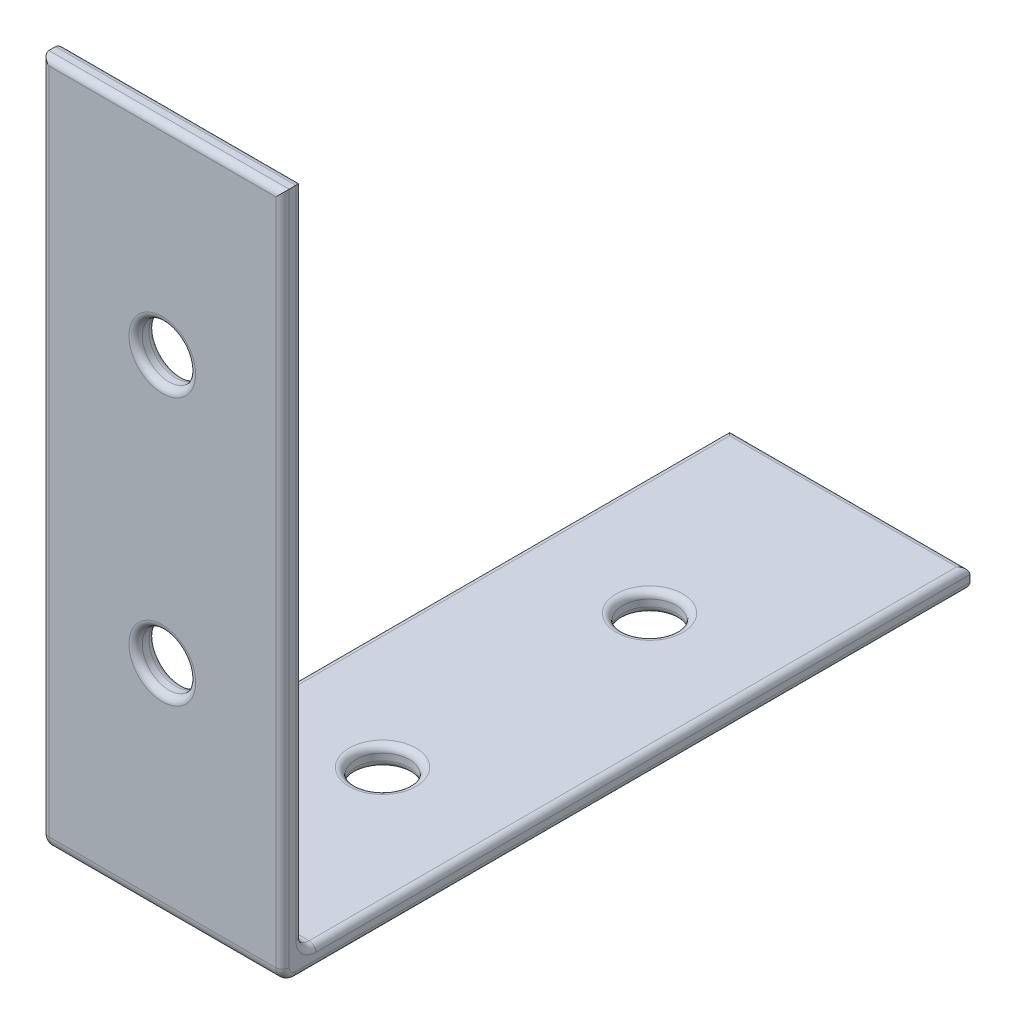
ISO-10303-21;
HEADER;
FILE_DESCRIPTION(('STEP AP214'),'2;1');
FILE_NAME('part.step','',(''),(''),'','','');
FILE_SCHEMA(('AUTOMOTIVE_DESIGN { 1 0 10303 214 1 1 1 1 }'));
ENDSEC;
DATA;
#1=APPLICATION_CONTEXT('core data for automotive mechanical design processes');
#2=APPLICATION_PROTOCOL_DEFINITION('international standard','automotive_design',2000,#1);
#3=PRODUCT_CONTEXT('',#1,'mechanical');
#4=PRODUCT('Part','Part','',(#3));
#5=PRODUCT_RELATED_PRODUCT_CATEGORY('part','',(#4));
#6=PRODUCT_DEFINITION_FORMATION('','',#4);
#7=PRODUCT_DEFINITION_CONTEXT('part definition',#1,'design');
#8=PRODUCT_DEFINITION('design','',#6,#7);
#9=PRODUCT_DEFINITION_SHAPE('','',#8);
#10=(LENGTH_UNIT() NAMED_UNIT(*) SI_UNIT(.MILLI.,.METRE.));
#11=(NAMED_UNIT(*) PLANE_ANGLE_UNIT() SI_UNIT($,.RADIAN.));
#12=(NAMED_UNIT(*) SI_UNIT($,.STERADIAN.) SOLID_ANGLE_UNIT());
#13=UNCERTAINTY_MEASURE_WITH_UNIT(LENGTH_MEASURE(1.E-05),#10,'distance_accuracy_value','');
#14=(GEOMETRIC_REPRESENTATION_CONTEXT(3) GLOBAL_UNCERTAINTY_ASSIGNED_CONTEXT((#13)) GLOBAL_UNIT_ASSIGNED_CONTEXT((#10,
#11,#12)) REPRESENTATION_CONTEXT('',''));
#15=CARTESIAN_POINT('',(0.,0.,0.));
#16=DIRECTION('',(0.,0.,1.));
#17=DIRECTION('',(1.,0.,0.));
#18=AXIS2_PLACEMENT_3D('',#15,#16,#17);
#19=CARTESIAN_POINT('',(18.,1.,-1.));
#20=DIRECTION('',(-1.,0.,0.));
#21=DIRECTION('',(0.,0.,1.));
#22=AXIS2_PLACEMENT_3D('',#19,#20,#21);
#23=CYLINDRICAL_SURFACE('',#22,1.);
#24=DIRECTION('',(-1.,0.,0.));
#25=VECTOR('',#24,1.);
#26=CARTESIAN_POINT('',(18.,1.00000000000001,0.));
#27=LINE('',#26,#25);
#28=CARTESIAN_POINT('',(17.5,1.00000000000001,0.));
#29=VERTEX_POINT('',#28);
#30=CARTESIAN_POINT('',(0.5,1.00000000000001,0.));
#31=VERTEX_POINT('',#30);
#32=EDGE_CURVE('E375',#29,#31,#27,.T.);
#33=ORIENTED_EDGE('',*,*,#32,.T.);
#34=CARTESIAN_POINT('',(0.5,1.,-1.));
#35=DIRECTION('',(1.,0.,0.));
#36=DIRECTION('',(0.,0.,-1.));
#37=AXIS2_PLACEMENT_3D('',#34,#35,#36);
#38=CIRCLE('',#37,1.);
#39=CARTESIAN_POINT('',(0.5,0.,-1.00000000000001));
#40=VERTEX_POINT('',#39);
#41=EDGE_CURVE('E168',#31,#40,#38,.T.);
#42=ORIENTED_EDGE('',*,*,#41,.T.);
#43=DIRECTION('',(-1.,0.,0.));
#44=VECTOR('',#43,1.);
#45=CARTESIAN_POINT('',(18.,0.,-1.00000000000001));
#46=LINE('',#45,#44);
#47=CARTESIAN_POINT('',(17.5,0.,-1.00000000000001));
#48=VERTEX_POINT('',#47);
#49=EDGE_CURVE('E154',#48,#40,#46,.T.);
#50=ORIENTED_EDGE('',*,*,#49,.F.);
#51=CARTESIAN_POINT('',(17.5,1.,-1.));
#52=DIRECTION('',(1.,0.,0.));
#53=DIRECTION('',(0.,0.,-1.));
#54=AXIS2_PLACEMENT_3D('',#51,#52,#53);
#55=CIRCLE('',#54,1.);
#56=EDGE_CURVE('E166',#48,#29,#55,.F.);
#57=ORIENTED_EDGE('',*,*,#56,.T.);
#58=EDGE_LOOP('',(#33,#42,#50,#57));
#59=FACE_BOUND('',#58,.T.);
#60=ADVANCED_FACE('F36',(#59),#23,.T.);
#61=CARTESIAN_POINT('',(18.,0.,0.));
#62=DIRECTION('',(0.,1.,0.));
#63=DIRECTION('',(0.,0.,1.));
#64=AXIS2_PLACEMENT_3D('',#61,#62,#63);
#65=PLANE('',#64);
#66=CARTESIAN_POINT('',(9.,0.,-36.5));
#67=DIRECTION('',(0.,1.,0.));
#68=DIRECTION('',(0.,0.,1.));
#69=AXIS2_PLACEMENT_3D('',#66,#67,#68);
#70=CIRCLE('',#69,2.5);
#71=CARTESIAN_POINT('',(9.,0.,-34.));
#72=VERTEX_POINT('',#71);
#73=EDGE_CURVE('E396',#72,#72,#70,.T.);
#74=ORIENTED_EDGE('',*,*,#73,.T.);
#75=EDGE_LOOP('',(#74));
#76=FACE_BOUND('',#75,.T.);
#77=CARTESIAN_POINT('',(9.,0.,-16.5));
#78=DIRECTION('',(0.,1.,0.));
#79=DIRECTION('',(0.,0.,1.));
#80=AXIS2_PLACEMENT_3D('',#77,#78,#79);
#81=CIRCLE('',#80,2.5);
#82=CARTESIAN_POINT('',(9.,0.,-14.));
#83=VERTEX_POINT('',#82);
#84=EDGE_CURVE('E393',#83,#83,#81,.T.);
#85=ORIENTED_EDGE('',*,*,#84,.T.);
#86=EDGE_LOOP('',(#85));
#87=FACE_BOUND('',#86,.T.);
#88=ORIENTED_EDGE('',*,*,#49,.T.);
#89=DIRECTION('',(0.,0.,-1.));
#90=VECTOR('',#89,1.);
#91=CARTESIAN_POINT('',(0.5,0.,0.));
#92=LINE('',#91,#90);
#93=CARTESIAN_POINT('',(0.5,0.,-51.));
#94=VERTEX_POINT('',#93);
#95=EDGE_CURVE('E391',#40,#94,#92,.T.);
#96=ORIENTED_EDGE('',*,*,#95,.T.);
#97=DIRECTION('',(-1.,0.,0.));
#98=VECTOR('',#97,1.);
#99=CARTESIAN_POINT('',(18.,0.,-51.));
#100=LINE('',#99,#98);
#101=CARTESIAN_POINT('',(17.5,0.,-51.));
#102=VERTEX_POINT('',#101);
#103=EDGE_CURVE('E157',#94,#102,#100,.F.);
#104=ORIENTED_EDGE('',*,*,#103,.T.);
#105=DIRECTION('',(0.,0.,-1.));
#106=VECTOR('',#105,1.);
#107=CARTESIAN_POINT('',(17.5,0.,-1.00000000000001));
#108=LINE('',#107,#106);
#109=EDGE_CURVE('E150',#102,#48,#108,.F.);
#110=ORIENTED_EDGE('',*,*,#109,.T.);
#111=EDGE_LOOP('',(#88,#96,#104,#110));
#112=FACE_BOUND('',#111,.T.);
#113=ADVANCED_FACE('F152',(#76,#87,#112),#65,.F.);
#114=CARTESIAN_POINT('',(18.,0.,-51.5));
#115=DIRECTION('',(0.,0.,1.));
#116=DIRECTION('',(1.,0.,0.));
#117=AXIS2_PLACEMENT_3D('',#114,#115,#116);
#118=PLANE('',#117);
#119=DIRECTION('',(0.,1.,0.));
#120=VECTOR('',#119,1.);
#121=CARTESIAN_POINT('',(18.,0.,-51.5));
#122=LINE('',#121,#120);
#123=CARTESIAN_POINT('',(18.,0.5,-51.5));
#124=VERTEX_POINT('',#123);
#125=CARTESIAN_POINT('',(18.,1.,-51.5));
#126=VERTEX_POINT('',#125);
#127=EDGE_CURVE('E243',#124,#126,#122,.T.);
#128=ORIENTED_EDGE('',*,*,#127,.F.);
#129=DIRECTION('',(-1.,0.,0.));
#130=VECTOR('',#129,1.);
#131=CARTESIAN_POINT('',(18.,0.5,-51.5));
#132=LINE('',#131,#130);
#133=CARTESIAN_POINT('',(0.,0.5,-51.5));
#134=VERTEX_POINT('',#133);
#135=EDGE_CURVE('E11',#124,#134,#132,.T.);
#136=ORIENTED_EDGE('',*,*,#135,.T.);
#137=DIRECTION('',(0.,1.,0.));
#138=VECTOR('',#137,1.);
#139=CARTESIAN_POINT('',(0.,0.,-51.5));
#140=LINE('',#139,#138);
#141=CARTESIAN_POINT('',(0.,1.,-51.5));
#142=VERTEX_POINT('',#141);
#143=EDGE_CURVE('E198',#134,#142,#140,.T.);
#144=ORIENTED_EDGE('',*,*,#143,.T.);
#145=DIRECTION('',(-1.,0.,0.));
#146=VECTOR('',#145,1.);
#147=CARTESIAN_POINT('',(18.,1.,-51.5));
#148=LINE('',#147,#146);
#149=EDGE_CURVE('E45',#142,#126,#148,.F.);
#150=ORIENTED_EDGE('',*,*,#149,.T.);
#151=EDGE_LOOP('',(#128,#136,#144,#150));
#152=FACE_BOUND('',#151,.T.);
#153=ADVANCED_FACE('F241',(#152),#118,.F.);
#154=CARTESIAN_POINT('',(18.,1.5,0.));
#155=DIRECTION('',(0.,1.,0.));
#156=DIRECTION('',(0.,0.,1.));
#157=AXIS2_PLACEMENT_3D('',#154,#155,#156);
#158=PLANE('',#157);
#159=CARTESIAN_POINT('',(9.,1.5,-36.5));
#160=DIRECTION('',(0.,1.,0.));
#161=DIRECTION('',(0.,0.,1.));
#162=AXIS2_PLACEMENT_3D('',#159,#160,#161);
#163=CIRCLE('',#162,2.5);
#164=CARTESIAN_POINT('',(9.,1.5,-34.));
#165=VERTEX_POINT('',#164);
#166=EDGE_CURVE('E271',#165,#165,#163,.F.);
#167=ORIENTED_EDGE('',*,*,#166,.T.);
#168=EDGE_LOOP('',(#167));
#169=FACE_BOUND('',#168,.T.);
#170=CARTESIAN_POINT('',(9.,1.5,-16.5));
#171=DIRECTION('',(0.,1.,0.));
#172=DIRECTION('',(0.,0.,1.));
#173=AXIS2_PLACEMENT_3D('',#170,#171,#172);
#174=CIRCLE('',#173,2.5);
#175=CARTESIAN_POINT('',(9.,1.5,-14.));
#176=VERTEX_POINT('',#175);
#177=EDGE_CURVE('E268',#176,#176,#174,.F.);
#178=ORIENTED_EDGE('',*,*,#177,.T.);
#179=EDGE_LOOP('',(#178));
#180=FACE_BOUND('',#179,.T.);
#181=DIRECTION('',(-1.,0.,0.));
#182=VECTOR('',#181,1.);
#183=CARTESIAN_POINT('',(0.,1.5,-51.));
#184=LINE('',#183,#182);
#185=CARTESIAN_POINT('',(17.5,1.5,-51.));
#186=VERTEX_POINT('',#185);
#187=CARTESIAN_POINT('',(0.5,1.5,-51.));
#188=VERTEX_POINT('',#187);
#189=EDGE_CURVE('E263',#186,#188,#184,.T.);
#190=ORIENTED_EDGE('',*,*,#189,.T.);
#191=DIRECTION('',(0.,0.,-1.));
#192=VECTOR('',#191,1.);
#193=CARTESIAN_POINT('',(0.5,1.5,-2.50000000000001));
#194=LINE('',#193,#192);
#195=CARTESIAN_POINT('',(0.5,1.5,-2.50000000000001));
#196=VERTEX_POINT('',#195);
#197=EDGE_CURVE('E265',#188,#196,#194,.F.);
#198=ORIENTED_EDGE('',*,*,#197,.T.);
#199=DIRECTION('',(-1.,0.,0.));
#200=VECTOR('',#199,1.);
#201=CARTESIAN_POINT('',(18.,1.5,-2.50000000000001));
#202=LINE('',#201,#200);
#203=CARTESIAN_POINT('',(17.5,1.5,-2.50000000000001));
#204=VERTEX_POINT('',#203);
#205=EDGE_CURVE('E169',#204,#196,#202,.T.);
#206=ORIENTED_EDGE('',*,*,#205,.F.);
#207=DIRECTION('',(0.,0.,-1.));
#208=VECTOR('',#207,1.);
#209=CARTESIAN_POINT('',(17.5,1.5,0.));
#210=LINE('',#209,#208);
#211=EDGE_CURVE('E261',#204,#186,#210,.T.);
#212=ORIENTED_EDGE('',*,*,#211,.T.);
#213=EDGE_LOOP('',(#190,#198,#206,#212));
#214=FACE_BOUND('',#213,.T.);
#215=ADVANCED_FACE('F355',(#169,#180,#214),#158,.T.);
#216=CARTESIAN_POINT('',(18.,2.5,-2.5));
#217=DIRECTION('',(-1.,0.,0.));
#218=DIRECTION('',(0.,0.,1.));
#219=AXIS2_PLACEMENT_3D('',#216,#217,#218);
#220=CYLINDRICAL_SURFACE('',#219,1.);
#221=ORIENTED_EDGE('',*,*,#205,.T.);
#222=CARTESIAN_POINT('',(0.5,2.5,-2.5));
#223=DIRECTION('',(1.,0.,0.));
#224=DIRECTION('',(0.,0.,-1.));
#225=AXIS2_PLACEMENT_3D('',#222,#223,#224);
#226=CIRCLE('',#225,1.);
#227=CARTESIAN_POINT('',(0.5,2.50000000000001,-1.5));
#228=VERTEX_POINT('',#227);
#229=EDGE_CURVE('E276',#196,#228,#226,.F.);
#230=ORIENTED_EDGE('',*,*,#229,.T.);
#231=DIRECTION('',(-1.,0.,0.));
#232=VECTOR('',#231,1.);
#233=CARTESIAN_POINT('',(18.,2.50000000000001,-1.5));
#234=LINE('',#233,#232);
#235=CARTESIAN_POINT('',(17.5,2.50000000000001,-1.5));
#236=VERTEX_POINT('',#235);
#237=EDGE_CURVE('E370',#236,#228,#234,.T.);
#238=ORIENTED_EDGE('',*,*,#237,.F.);
#239=CARTESIAN_POINT('',(17.5,2.5,-2.5));
#240=DIRECTION('',(1.,0.,0.));
#241=DIRECTION('',(0.,0.,-1.));
#242=AXIS2_PLACEMENT_3D('',#239,#240,#241);
#243=CIRCLE('',#242,1.);
#244=EDGE_CURVE('E274',#236,#204,#243,.T.);
#245=ORIENTED_EDGE('',*,*,#244,.T.);
#246=EDGE_LOOP('',(#221,#230,#238,#245));
#247=FACE_BOUND('',#246,.T.);
#248=ADVANCED_FACE('F369',(#247),#220,.F.);
#249=CARTESIAN_POINT('',(18.,0.,-1.5));
#250=DIRECTION('',(0.,0.,1.));
#251=DIRECTION('',(0.,-1.,0.));
#252=AXIS2_PLACEMENT_3D('',#249,#250,#251);
#253=PLANE('',#252);
#254=CARTESIAN_POINT('',(9.,16.5,-1.5));
#255=DIRECTION('',(0.,0.,1.));
#256=DIRECTION('',(0.,-1.,0.));
#257=AXIS2_PLACEMENT_3D('',#254,#255,#256);
#258=CIRCLE('',#257,2.5);
#259=CARTESIAN_POINT('',(9.,14.,-1.5));
#260=VERTEX_POINT('',#259);
#261=EDGE_CURVE('E298',#260,#260,#258,.T.);
#262=ORIENTED_EDGE('',*,*,#261,.T.);
#263=EDGE_LOOP('',(#262));
#264=FACE_BOUND('',#263,.T.);
#265=CARTESIAN_POINT('',(9.,36.5,-1.5));
#266=DIRECTION('',(0.,0.,1.));
#267=DIRECTION('',(0.,-1.,0.));
#268=AXIS2_PLACEMENT_3D('',#265,#266,#267);
#269=CIRCLE('',#268,2.5);
#270=CARTESIAN_POINT('',(9.,34.,-1.5));
#271=VERTEX_POINT('',#270);
#272=EDGE_CURVE('E295',#271,#271,#269,.T.);
#273=ORIENTED_EDGE('',*,*,#272,.T.);
#274=EDGE_LOOP('',(#273));
#275=FACE_BOUND('',#274,.T.);
#276=DIRECTION('',(-1.,0.,0.));
#277=VECTOR('',#276,1.);
#278=CARTESIAN_POINT('',(18.,51.,-1.5));
#279=LINE('',#278,#277);
#280=CARTESIAN_POINT('',(0.5,51.,-1.5));
#281=VERTEX_POINT('',#280);
#282=CARTESIAN_POINT('',(17.5,51.,-1.5));
#283=VERTEX_POINT('',#282);
#284=EDGE_CURVE('E291',#281,#283,#279,.F.);
#285=ORIENTED_EDGE('',*,*,#284,.T.);
#286=DIRECTION('',(0.,1.,0.));
#287=VECTOR('',#286,1.);
#288=CARTESIAN_POINT('',(17.5,2.50000000000001,-1.5));
#289=LINE('',#288,#287);
#290=EDGE_CURVE('E293',#283,#236,#289,.F.);
#291=ORIENTED_EDGE('',*,*,#290,.T.);
#292=ORIENTED_EDGE('',*,*,#237,.T.);
#293=DIRECTION('',(0.,1.,0.));
#294=VECTOR('',#293,1.);
#295=CARTESIAN_POINT('',(0.5,0.,-1.5));
#296=LINE('',#295,#294);
#297=EDGE_CURVE('E289',#228,#281,#296,.T.);
#298=ORIENTED_EDGE('',*,*,#297,.T.);
#299=EDGE_LOOP('',(#285,#291,#292,#298));
#300=FACE_BOUND('',#299,.T.);
#301=ADVANCED_FACE('F373',(#264,#275,#300),#253,.F.);
#302=CARTESIAN_POINT('',(18.,51.5,0.));
#303=DIRECTION('',(0.,1.,0.));
#304=DIRECTION('',(0.,0.,1.));
#305=AXIS2_PLACEMENT_3D('',#302,#303,#304);
#306=PLANE('',#305);
#307=DIRECTION('',(0.,0.,-1.));
#308=VECTOR('',#307,1.);
#309=CARTESIAN_POINT('',(18.,51.5,0.));
#310=LINE('',#309,#308);
#311=CARTESIAN_POINT('',(18.,51.5,-0.5));
#312=VERTEX_POINT('',#311);
#313=CARTESIAN_POINT('',(18.,51.5,-1.));
#314=VERTEX_POINT('',#313);
#315=EDGE_CURVE('E344',#312,#314,#310,.T.);
#316=ORIENTED_EDGE('',*,*,#315,.T.);
#317=DIRECTION('',(-1.,0.,0.));
#318=VECTOR('',#317,1.);
#319=CARTESIAN_POINT('',(0.,51.5,-1.));
#320=LINE('',#319,#318);
#321=CARTESIAN_POINT('',(0.,51.5,-1.));
#322=VERTEX_POINT('',#321);
#323=EDGE_CURVE('E313',#314,#322,#320,.T.);
#324=ORIENTED_EDGE('',*,*,#323,.T.);
#325=DIRECTION('',(0.,0.,-1.));
#326=VECTOR('',#325,1.);
#327=CARTESIAN_POINT('',(0.,51.5,0.));
#328=LINE('',#327,#326);
#329=CARTESIAN_POINT('',(0.,51.5,-0.5));
#330=VERTEX_POINT('',#329);
#331=EDGE_CURVE('E250',#330,#322,#328,.T.);
#332=ORIENTED_EDGE('',*,*,#331,.F.);
#333=DIRECTION('',(-1.,0.,0.));
#334=VECTOR('',#333,1.);
#335=CARTESIAN_POINT('',(18.,51.5,-0.5));
#336=LINE('',#335,#334);
#337=EDGE_CURVE('E311',#330,#312,#336,.F.);
#338=ORIENTED_EDGE('',*,*,#337,.T.);
#339=EDGE_LOOP('',(#316,#324,#332,#338));
#340=FACE_BOUND('',#339,.T.);
#341=ADVANCED_FACE('F410',(#340),#306,.T.);
#342=CARTESIAN_POINT('',(18.,0.,0.));
#343=DIRECTION('',(0.,0.,1.));
#344=DIRECTION('',(1.,0.,0.));
#345=AXIS2_PLACEMENT_3D('',#342,#343,#344);
#346=PLANE('',#345);
#347=CARTESIAN_POINT('',(9.,16.5,0.));
#348=DIRECTION('',(0.,0.,1.));
#349=DIRECTION('',(1.,0.,0.));
#350=AXIS2_PLACEMENT_3D('',#347,#348,#349);
#351=CIRCLE('',#350,2.5);
#352=CARTESIAN_POINT('',(11.5,16.5,0.));
#353=VERTEX_POINT('',#352);
#354=EDGE_CURVE('E308',#353,#353,#351,.F.);
#355=ORIENTED_EDGE('',*,*,#354,.T.);
#356=EDGE_LOOP('',(#355));
#357=FACE_BOUND('',#356,.T.);
#358=CARTESIAN_POINT('',(9.,36.5,0.));
#359=DIRECTION('',(0.,0.,1.));
#360=DIRECTION('',(1.,0.,0.));
#361=AXIS2_PLACEMENT_3D('',#358,#359,#360);
#362=CIRCLE('',#361,2.5);
#363=CARTESIAN_POINT('',(11.5,36.5,0.));
#364=VERTEX_POINT('',#363);
#365=EDGE_CURVE('E305',#364,#364,#362,.F.);
#366=ORIENTED_EDGE('',*,*,#365,.T.);
#367=EDGE_LOOP('',(#366));
#368=FACE_BOUND('',#367,.T.);
#369=ORIENTED_EDGE('',*,*,#32,.F.);
#370=DIRECTION('',(0.,1.,0.));
#371=VECTOR('',#370,1.);
#372=CARTESIAN_POINT('',(17.5,0.,0.));
#373=LINE('',#372,#371);
#374=CARTESIAN_POINT('',(17.5,51.,0.));
#375=VERTEX_POINT('',#374);
#376=EDGE_CURVE('E53',#29,#375,#373,.T.);
#377=ORIENTED_EDGE('',*,*,#376,.T.);
#378=DIRECTION('',(-1.,0.,0.));
#379=VECTOR('',#378,1.);
#380=CARTESIAN_POINT('',(18.,51.,0.));
#381=LINE('',#380,#379);
#382=CARTESIAN_POINT('',(0.5,51.,0.));
#383=VERTEX_POINT('',#382);
#384=EDGE_CURVE('E58',#375,#383,#381,.T.);
#385=ORIENTED_EDGE('',*,*,#384,.T.);
#386=DIRECTION('',(0.,1.,0.));
#387=VECTOR('',#386,1.);
#388=CARTESIAN_POINT('',(0.5,1.00000000000001,0.));
#389=LINE('',#388,#387);
#390=EDGE_CURVE('E301',#383,#31,#389,.F.);
#391=ORIENTED_EDGE('',*,*,#390,.T.);
#392=EDGE_LOOP('',(#369,#377,#385,#391));
#393=FACE_BOUND('',#392,.T.);
#394=ADVANCED_FACE('F417',(#357,#368,#393),#346,.T.);
#395=CARTESIAN_POINT('',(18.,0.,0.));
#396=DIRECTION('',(1.,0.,0.));
#397=DIRECTION('',(0.,0.,-1.));
#398=AXIS2_PLACEMENT_3D('',#395,#396,#397);
#399=PLANE('',#398);
#400=CARTESIAN_POINT('',(18.,2.5,-2.5));
#401=DIRECTION('',(1.,0.,0.));
#402=DIRECTION('',(0.,0.,-1.));
#403=AXIS2_PLACEMENT_3D('',#400,#401,#402);
#404=CIRCLE('',#403,1.5);
#405=CARTESIAN_POINT('',(18.,1.,-2.50000000000001));
#406=VERTEX_POINT('',#405);
#407=CARTESIAN_POINT('',(18.,2.50000000000001,-1.));
#408=VERTEX_POINT('',#407);
#409=EDGE_CURVE('E285',#406,#408,#404,.F.);
#410=ORIENTED_EDGE('',*,*,#409,.T.);
#411=DIRECTION('',(0.,1.,0.));
#412=VECTOR('',#411,1.);
#413=CARTESIAN_POINT('',(18.,51.5,-1.));
#414=LINE('',#413,#412);
#415=EDGE_CURVE('E287',#408,#314,#414,.T.);
#416=ORIENTED_EDGE('',*,*,#415,.T.);
#417=ORIENTED_EDGE('',*,*,#315,.F.);
#418=DIRECTION('',(0.,1.,0.));
#419=VECTOR('',#418,1.);
#420=CARTESIAN_POINT('',(18.,0.,-0.5));
#421=LINE('',#420,#419);
#422=CARTESIAN_POINT('',(18.,1.00000000000001,-0.5));
#423=VERTEX_POINT('',#422);
#424=EDGE_CURVE('E281',#312,#423,#421,.F.);
#425=ORIENTED_EDGE('',*,*,#424,.T.);
#426=CARTESIAN_POINT('',(18.,1.,-1.));
#427=DIRECTION('',(1.,0.,0.));
#428=DIRECTION('',(0.,0.,-1.));
#429=AXIS2_PLACEMENT_3D('',#426,#427,#428);
#430=CIRCLE('',#429,0.5);
#431=CARTESIAN_POINT('',(18.,0.5,-1.));
#432=VERTEX_POINT('',#431);
#433=EDGE_CURVE('E279',#423,#432,#430,.T.);
#434=ORIENTED_EDGE('',*,*,#433,.T.);
#435=DIRECTION('',(0.,0.,-1.));
#436=VECTOR('',#435,1.);
#437=CARTESIAN_POINT('',(18.,0.5,-51.5));
#438=LINE('',#437,#436);
#439=EDGE_CURVE('E183',#432,#124,#438,.T.);
#440=ORIENTED_EDGE('',*,*,#439,.T.);
#441=ORIENTED_EDGE('',*,*,#127,.T.);
#442=DIRECTION('',(0.,0.,-1.));
#443=VECTOR('',#442,1.);
#444=CARTESIAN_POINT('',(18.,1.,0.));
#445=LINE('',#444,#443);
#446=EDGE_CURVE('E283',#126,#406,#445,.F.);
#447=ORIENTED_EDGE('',*,*,#446,.T.);
#448=EDGE_LOOP('',(#410,#416,#417,#425,#434,#440,#441,#447));
#449=FACE_BOUND('',#448,.T.);
#450=ADVANCED_FACE('F343',(#449),#399,.T.);
#451=CARTESIAN_POINT('',(0.,0.,0.));
#452=DIRECTION('',(1.,0.,0.));
#453=DIRECTION('',(0.,0.,-1.));
#454=AXIS2_PLACEMENT_3D('',#451,#452,#453);
#455=PLANE('',#454);
#456=ORIENTED_EDGE('',*,*,#143,.F.);
#457=DIRECTION('',(0.,0.,-1.));
#458=VECTOR('',#457,1.);
#459=CARTESIAN_POINT('',(0.,0.5,0.));
#460=LINE('',#459,#458);
#461=CARTESIAN_POINT('',(0.,0.5,-1.00000000000001));
#462=VERTEX_POINT('',#461);
#463=EDGE_CURVE('E180',#134,#462,#460,.F.);
#464=ORIENTED_EDGE('',*,*,#463,.T.);
#465=CARTESIAN_POINT('',(0.,1.,-1.));
#466=DIRECTION('',(1.,0.,0.));
#467=DIRECTION('',(0.,0.,-1.));
#468=AXIS2_PLACEMENT_3D('',#465,#466,#467);
#469=CIRCLE('',#468,0.5);
#470=CARTESIAN_POINT('',(0.,1.,-0.5));
#471=VERTEX_POINT('',#470);
#472=EDGE_CURVE('E254',#462,#471,#469,.F.);
#473=ORIENTED_EDGE('',*,*,#472,.T.);
#474=DIRECTION('',(0.,1.,0.));
#475=VECTOR('',#474,1.);
#476=CARTESIAN_POINT('',(0.,51.5,-0.5));
#477=LINE('',#476,#475);
#478=EDGE_CURVE('E256',#471,#330,#477,.T.);
#479=ORIENTED_EDGE('',*,*,#478,.T.);
#480=ORIENTED_EDGE('',*,*,#331,.T.);
#481=DIRECTION('',(0.,1.,0.));
#482=VECTOR('',#481,1.);
#483=CARTESIAN_POINT('',(0.,0.,-1.));
#484=LINE('',#483,#482);
#485=CARTESIAN_POINT('',(0.,2.50000000000001,-1.));
#486=VERTEX_POINT('',#485);
#487=EDGE_CURVE('E381',#322,#486,#484,.F.);
#488=ORIENTED_EDGE('',*,*,#487,.T.);
#489=CARTESIAN_POINT('',(0.,2.5,-2.5));
#490=DIRECTION('',(1.,0.,0.));
#491=DIRECTION('',(0.,0.,-1.));
#492=AXIS2_PLACEMENT_3D('',#489,#490,#491);
#493=CIRCLE('',#492,1.5);
#494=CARTESIAN_POINT('',(0.,1.,-2.50000000000001));
#495=VERTEX_POINT('',#494);
#496=EDGE_CURVE('E400',#486,#495,#493,.T.);
#497=ORIENTED_EDGE('',*,*,#496,.T.);
#498=DIRECTION('',(0.,0.,-1.));
#499=VECTOR('',#498,1.);
#500=CARTESIAN_POINT('',(0.,1.,-51.5));
#501=LINE('',#500,#499);
#502=EDGE_CURVE('E249',#495,#142,#501,.T.);
#503=ORIENTED_EDGE('',*,*,#502,.T.);
#504=EDGE_LOOP('',(#456,#464,#473,#479,#480,#488,#497,#503));
#505=FACE_BOUND('',#504,.T.);
#506=ADVANCED_FACE('F247',(#505),#455,.F.);
#507=CARTESIAN_POINT('',(9.,0.,-16.5));
#508=DIRECTION('',(0.,1.,0.));
#509=DIRECTION('',(0.,0.,1.));
#510=AXIS2_PLACEMENT_3D('',#507,#508,#509);
#511=CYLINDRICAL_SURFACE('',#510,2.);
#512=CARTESIAN_POINT('',(9.,1.,-16.5));
#513=DIRECTION('',(0.,1.,0.));
#514=DIRECTION('',(0.,0.,1.));
#515=AXIS2_PLACEMENT_3D('',#512,#513,#514);
#516=CIRCLE('',#515,2.);
#517=CARTESIAN_POINT('',(9.,1.,-14.5));
#518=VERTEX_POINT('',#517);
#519=EDGE_CURVE('E324',#518,#518,#516,.T.);
#520=ORIENTED_EDGE('',*,*,#519,.T.);
#521=EDGE_LOOP('',(#520));
#522=FACE_BOUND('',#521,.T.);
#523=CARTESIAN_POINT('',(9.,0.5,-16.5));
#524=DIRECTION('',(0.,1.,0.));
#525=DIRECTION('',(0.,0.,1.));
#526=AXIS2_PLACEMENT_3D('',#523,#524,#525);
#527=CIRCLE('',#526,2.);
#528=CARTESIAN_POINT('',(9.,0.5,-14.5));
#529=VERTEX_POINT('',#528);
#530=EDGE_CURVE('E321',#529,#529,#527,.F.);
#531=ORIENTED_EDGE('',*,*,#530,.T.);
#532=EDGE_LOOP('',(#531));
#533=FACE_BOUND('',#532,.T.);
#534=ADVANCED_FACE('F662',(#522,#533),#511,.F.);
#535=CARTESIAN_POINT('',(9.,0.,-36.5));
#536=DIRECTION('',(0.,1.,0.));
#537=DIRECTION('',(0.,0.,1.));
#538=AXIS2_PLACEMENT_3D('',#535,#536,#537);
#539=CYLINDRICAL_SURFACE('',#538,2.);
#540=CARTESIAN_POINT('',(9.,0.5,-36.5));
#541=DIRECTION('',(0.,1.,0.));
#542=DIRECTION('',(0.,0.,1.));
#543=AXIS2_PLACEMENT_3D('',#540,#541,#542);
#544=CIRCLE('',#543,2.);
#545=CARTESIAN_POINT('',(9.,0.5,-34.5));
#546=VERTEX_POINT('',#545);
#547=EDGE_CURVE('E318',#546,#546,#544,.F.);
#548=ORIENTED_EDGE('',*,*,#547,.T.);
#549=EDGE_LOOP('',(#548));
#550=FACE_BOUND('',#549,.T.);
#551=CARTESIAN_POINT('',(9.,1.,-36.5));
#552=DIRECTION('',(0.,1.,0.));
#553=DIRECTION('',(0.,0.,1.));
#554=AXIS2_PLACEMENT_3D('',#551,#552,#553);
#555=CIRCLE('',#554,2.);
#556=CARTESIAN_POINT('',(9.,1.,-34.5));
#557=VERTEX_POINT('',#556);
#558=EDGE_CURVE('E315',#557,#557,#555,.T.);
#559=ORIENTED_EDGE('',*,*,#558,.T.);
#560=EDGE_LOOP('',(#559));
#561=FACE_BOUND('',#560,.T.);
#562=ADVANCED_FACE('F653',(#550,#561),#539,.F.);
#563=CARTESIAN_POINT('',(9.,16.5,0.));
#564=DIRECTION('',(0.,0.,-1.));
#565=DIRECTION('',(0.,1.,0.));
#566=AXIS2_PLACEMENT_3D('',#563,#564,#565);
#567=CYLINDRICAL_SURFACE('',#566,2.);
#568=CARTESIAN_POINT('',(9.,16.5,-0.5));
#569=DIRECTION('',(0.,0.,1.));
#570=DIRECTION('',(1.,0.,0.));
#571=AXIS2_PLACEMENT_3D('',#568,#569,#570);
#572=CIRCLE('',#571,2.);
#573=CARTESIAN_POINT('',(11.,16.5,-0.5));
#574=VERTEX_POINT('',#573);
#575=EDGE_CURVE('E330',#574,#574,#572,.T.);
#576=ORIENTED_EDGE('',*,*,#575,.T.);
#577=EDGE_LOOP('',(#576));
#578=FACE_BOUND('',#577,.T.);
#579=CARTESIAN_POINT('',(9.,16.5,-1.));
#580=DIRECTION('',(0.,0.,1.));
#581=DIRECTION('',(0.,-1.,0.));
#582=AXIS2_PLACEMENT_3D('',#579,#580,#581);
#583=CIRCLE('',#582,2.);
#584=CARTESIAN_POINT('',(9.,14.5,-1.));
#585=VERTEX_POINT('',#584);
#586=EDGE_CURVE('E327',#585,#585,#583,.F.);
#587=ORIENTED_EDGE('',*,*,#586,.T.);
#588=EDGE_LOOP('',(#587));
#589=FACE_BOUND('',#588,.T.);
#590=ADVANCED_FACE('F430',(#578,#589),#567,.F.);
#591=CARTESIAN_POINT('',(9.,36.5,0.));
#592=DIRECTION('',(0.,0.,-1.));
#593=DIRECTION('',(0.,1.,0.));
#594=AXIS2_PLACEMENT_3D('',#591,#592,#593);
#595=CYLINDRICAL_SURFACE('',#594,2.);
#596=CARTESIAN_POINT('',(9.,36.5,-0.5));
#597=DIRECTION('',(0.,0.,1.));
#598=DIRECTION('',(1.,0.,0.));
#599=AXIS2_PLACEMENT_3D('',#596,#597,#598);
#600=CIRCLE('',#599,2.);
#601=CARTESIAN_POINT('',(11.,36.5,-0.5));
#602=VERTEX_POINT('',#601);
#603=EDGE_CURVE('E336',#602,#602,#600,.T.);
#604=ORIENTED_EDGE('',*,*,#603,.T.);
#605=EDGE_LOOP('',(#604));
#606=FACE_BOUND('',#605,.T.);
#607=CARTESIAN_POINT('',(9.,36.5,-1.));
#608=DIRECTION('',(0.,0.,1.));
#609=DIRECTION('',(0.,-1.,0.));
#610=AXIS2_PLACEMENT_3D('',#607,#608,#609);
#611=CIRCLE('',#610,2.);
#612=CARTESIAN_POINT('',(9.,34.5,-1.));
#613=VERTEX_POINT('',#612);
#614=EDGE_CURVE('E333',#613,#613,#611,.F.);
#615=ORIENTED_EDGE('',*,*,#614,.T.);
#616=EDGE_LOOP('',(#615));
#617=FACE_BOUND('',#616,.T.);
#618=ADVANCED_FACE('F423',(#606,#617),#595,.F.);
#619=CARTESIAN_POINT('',(17.5,0.,-0.5));
#620=DIRECTION('',(0.,1.,0.));
#621=DIRECTION('',(0.,0.,1.));
#622=AXIS2_PLACEMENT_3D('',#619,#620,#621);
#623=CYLINDRICAL_SURFACE('',#622,0.5);
#624=CARTESIAN_POINT('',(17.5,1.00000000000001,-0.5));
#625=DIRECTION('',(0.,-1.,0.));
#626=DIRECTION('',(0.,0.,-1.));
#627=AXIS2_PLACEMENT_3D('',#624,#625,#626);
#628=CIRCLE('',#627,0.5);
#629=EDGE_CURVE('E179',#423,#29,#628,.T.);
#630=ORIENTED_EDGE('',*,*,#629,.F.);
#631=ORIENTED_EDGE('',*,*,#424,.F.);
#632=CARTESIAN_POINT('',(17.5,51.,-0.5));
#633=DIRECTION('',(-0.707106781186547,0.707106781186547,0.));
#634=DIRECTION('',(-0.707106781186547,-0.707106781186547,0.));
#635=AXIS2_PLACEMENT_3D('',#632,#633,#634);
#636=ELLIPSE('',#635,0.707106781186547,0.5);
#637=EDGE_CURVE('E195',#375,#312,#636,.T.);
#638=ORIENTED_EDGE('',*,*,#637,.F.);
#639=ORIENTED_EDGE('',*,*,#376,.F.);
#640=EDGE_LOOP('',(#630,#631,#638,#639));
#641=FACE_BOUND('',#640,.T.);
#642=ADVANCED_FACE('F421',(#641),#623,.T.);
#643=CARTESIAN_POINT('',(18.,51.,-0.5));
#644=DIRECTION('',(-1.,0.,0.));
#645=DIRECTION('',(0.,0.,1.));
#646=AXIS2_PLACEMENT_3D('',#643,#644,#645);
#647=CYLINDRICAL_SURFACE('',#646,0.5);
#648=ORIENTED_EDGE('',*,*,#637,.T.);
#649=ORIENTED_EDGE('',*,*,#337,.F.);
#650=CARTESIAN_POINT('',(0.5,51.,-0.5));
#651=DIRECTION('',(-0.707106781186547,-0.707106781186547,0.));
#652=DIRECTION('',(0.707106781186547,-0.707106781186547,0.));
#653=AXIS2_PLACEMENT_3D('',#650,#651,#652);
#654=ELLIPSE('',#653,0.707106781186547,0.5);
#655=EDGE_CURVE('E184',#383,#330,#654,.T.);
#656=ORIENTED_EDGE('',*,*,#655,.F.);
#657=ORIENTED_EDGE('',*,*,#384,.F.);
#658=EDGE_LOOP('',(#648,#649,#656,#657));
#659=FACE_BOUND('',#658,.T.);
#660=ADVANCED_FACE('F414',(#659),#647,.T.);
#661=CARTESIAN_POINT('',(17.5,1.,-1.));
#662=DIRECTION('',(1.,0.,0.));
#663=DIRECTION('',(0.,0.,-1.));
#664=AXIS2_PLACEMENT_3D('',#661,#662,#663);
#665=DEGENERATE_TOROIDAL_SURFACE('',#664,0.5,0.5,.T.);
#666=ORIENTED_EDGE('',*,*,#629,.T.);
#667=ORIENTED_EDGE('',*,*,#56,.F.);
#668=CARTESIAN_POINT('',(17.5,0.5,-1.));
#669=DIRECTION('',(0.,0.,-1.));
#670=DIRECTION('',(0.,1.,0.));
#671=AXIS2_PLACEMENT_3D('',#668,#669,#670);
#672=CIRCLE('',#671,0.5);
#673=EDGE_CURVE('E176',#432,#48,#672,.T.);
#674=ORIENTED_EDGE('',*,*,#673,.F.);
#675=ORIENTED_EDGE('',*,*,#433,.F.);
#676=EDGE_LOOP('',(#666,#667,#674,#675));
#677=FACE_BOUND('',#676,.T.);
#678=ADVANCED_FACE('F174',(#677),#665,.T.);
#679=CARTESIAN_POINT('',(0.5,0.,-0.5));
#680=DIRECTION('',(0.,-1.,0.));
#681=DIRECTION('',(0.,0.,-1.));
#682=AXIS2_PLACEMENT_3D('',#679,#680,#681);
#683=CYLINDRICAL_SURFACE('',#682,0.5);
#684=ORIENTED_EDGE('',*,*,#655,.T.);
#685=ORIENTED_EDGE('',*,*,#478,.F.);
#686=CARTESIAN_POINT('',(0.5,1.00000000000001,-0.5));
#687=DIRECTION('',(0.,-1.,0.));
#688=DIRECTION('',(1.,0.,0.));
#689=AXIS2_PLACEMENT_3D('',#686,#687,#688);
#690=CIRCLE('',#689,0.5);
#691=EDGE_CURVE('E185',#31,#471,#690,.T.);
#692=ORIENTED_EDGE('',*,*,#691,.F.);
#693=ORIENTED_EDGE('',*,*,#390,.F.);
#694=EDGE_LOOP('',(#684,#685,#692,#693));
#695=FACE_BOUND('',#694,.T.);
#696=ADVANCED_FACE('F416',(#695),#683,.T.);
#697=CARTESIAN_POINT('',(17.5,0.5,0.));
#698=DIRECTION('',(0.,0.,1.));
#699=DIRECTION('',(1.,0.,0.));
#700=AXIS2_PLACEMENT_3D('',#697,#698,#699);
#701=CYLINDRICAL_SURFACE('',#700,0.5);
#702=ORIENTED_EDGE('',*,*,#673,.T.);
#703=ORIENTED_EDGE('',*,*,#109,.F.);
#704=CARTESIAN_POINT('',(17.5,0.5,-51.));
#705=DIRECTION('',(0.707106781186547,0.,0.707106781186547));
#706=DIRECTION('',(-0.707106781186547,0.,0.707106781186547));
#707=AXIS2_PLACEMENT_3D('',#704,#705,#706);
#708=ELLIPSE('',#707,0.707106781186547,0.5);
#709=EDGE_CURVE('E190',#124,#102,#708,.F.);
#710=ORIENTED_EDGE('',*,*,#709,.F.);
#711=ORIENTED_EDGE('',*,*,#439,.F.);
#712=EDGE_LOOP('',(#702,#703,#710,#711));
#713=FACE_BOUND('',#712,.T.);
#714=ADVANCED_FACE('F182',(#713),#701,.T.);
#715=CARTESIAN_POINT('',(0.5,1.,-1.));
#716=DIRECTION('',(1.,0.,0.));
#717=DIRECTION('',(0.,0.,-1.));
#718=AXIS2_PLACEMENT_3D('',#715,#716,#717);
#719=DEGENERATE_TOROIDAL_SURFACE('',#718,0.5,0.5,.T.);
#720=ORIENTED_EDGE('',*,*,#691,.T.);
#721=ORIENTED_EDGE('',*,*,#472,.F.);
#722=CARTESIAN_POINT('',(0.5,0.5,-1.));
#723=DIRECTION('',(0.,0.,-1.));
#724=DIRECTION('',(0.,1.,0.));
#725=AXIS2_PLACEMENT_3D('',#722,#723,#724);
#726=CIRCLE('',#725,0.5);
#727=EDGE_CURVE('E226',#40,#462,#726,.T.);
#728=ORIENTED_EDGE('',*,*,#727,.F.);
#729=ORIENTED_EDGE('',*,*,#41,.F.);
#730=EDGE_LOOP('',(#720,#721,#728,#729));
#731=FACE_BOUND('',#730,.T.);
#732=ADVANCED_FACE('F447',(#731),#719,.T.);
#733=CARTESIAN_POINT('',(18.,0.5,-51.));
#734=DIRECTION('',(-1.,0.,0.));
#735=DIRECTION('',(0.,0.,1.));
#736=AXIS2_PLACEMENT_3D('',#733,#734,#735);
#737=CYLINDRICAL_SURFACE('',#736,0.5);
#738=ORIENTED_EDGE('',*,*,#709,.T.);
#739=ORIENTED_EDGE('',*,*,#103,.F.);
#740=CARTESIAN_POINT('',(0.5,0.5,-51.));
#741=DIRECTION('',(-0.707106781186547,0.,0.707106781186547));
#742=DIRECTION('',(-0.707106781186547,0.,-0.707106781186547));
#743=AXIS2_PLACEMENT_3D('',#740,#741,#742);
#744=ELLIPSE('',#743,0.707106781186547,0.5);
#745=EDGE_CURVE('E221',#134,#94,#744,.T.);
#746=ORIENTED_EDGE('',*,*,#745,.F.);
#747=ORIENTED_EDGE('',*,*,#135,.F.);
#748=EDGE_LOOP('',(#738,#739,#746,#747));
#749=FACE_BOUND('',#748,.T.);
#750=ADVANCED_FACE('F236',(#749),#737,.T.);
#751=CARTESIAN_POINT('',(0.5,0.5,0.));
#752=DIRECTION('',(0.,0.,-1.));
#753=DIRECTION('',(-1.,0.,0.));
#754=AXIS2_PLACEMENT_3D('',#751,#752,#753);
#755=CYLINDRICAL_SURFACE('',#754,0.5);
#756=ORIENTED_EDGE('',*,*,#727,.T.);
#757=ORIENTED_EDGE('',*,*,#463,.F.);
#758=ORIENTED_EDGE('',*,*,#745,.T.);
#759=ORIENTED_EDGE('',*,*,#95,.F.);
#760=EDGE_LOOP('',(#756,#757,#758,#759));
#761=FACE_BOUND('',#760,.T.);
#762=ADVANCED_FACE('F252',(#761),#755,.T.);
#763=CARTESIAN_POINT('',(17.5,0.,-1.));
#764=DIRECTION('',(0.,-1.,0.));
#765=DIRECTION('',(0.,0.,-1.));
#766=AXIS2_PLACEMENT_3D('',#763,#764,#765);
#767=CYLINDRICAL_SURFACE('',#766,0.5);
#768=CARTESIAN_POINT('',(17.5,2.50000000000001,-1.));
#769=DIRECTION('',(0.,-1.,0.));
#770=DIRECTION('',(0.,0.,-1.));
#771=AXIS2_PLACEMENT_3D('',#768,#769,#770);
#772=CIRCLE('',#771,0.5);
#773=EDGE_CURVE('E214',#236,#408,#772,.T.);
#774=ORIENTED_EDGE('',*,*,#773,.F.);
#775=ORIENTED_EDGE('',*,*,#290,.F.);
#776=CARTESIAN_POINT('',(17.5,51.,-1.));
#777=DIRECTION('',(0.707106781186547,-0.707106781186547,0.));
#778=DIRECTION('',(0.707106781186547,0.707106781186547,0.));
#779=AXIS2_PLACEMENT_3D('',#776,#777,#778);
#780=ELLIPSE('',#779,0.707106781186547,0.5);
#781=EDGE_CURVE('E40',#314,#283,#780,.F.);
#782=ORIENTED_EDGE('',*,*,#781,.F.);
#783=ORIENTED_EDGE('',*,*,#415,.F.);
#784=EDGE_LOOP('',(#774,#775,#782,#783));
#785=FACE_BOUND('',#784,.T.);
#786=ADVANCED_FACE('F384',(#785),#767,.T.);
#787=CARTESIAN_POINT('',(18.,51.,-1.));
#788=DIRECTION('',(1.,0.,0.));
#789=DIRECTION('',(0.,0.,-1.));
#790=AXIS2_PLACEMENT_3D('',#787,#788,#789);
#791=CYLINDRICAL_SURFACE('',#790,0.5);
#792=ORIENTED_EDGE('',*,*,#781,.T.);
#793=ORIENTED_EDGE('',*,*,#284,.F.);
#794=CARTESIAN_POINT('',(0.5,51.,-1.));
#795=DIRECTION('',(0.707106781186547,0.707106781186547,0.));
#796=DIRECTION('',(-0.707106781186547,0.707106781186547,0.));
#797=AXIS2_PLACEMENT_3D('',#794,#795,#796);
#798=ELLIPSE('',#797,0.707106781186547,0.5);
#799=EDGE_CURVE('E212',#322,#281,#798,.F.);
#800=ORIENTED_EDGE('',*,*,#799,.F.);
#801=ORIENTED_EDGE('',*,*,#323,.F.);
#802=EDGE_LOOP('',(#792,#793,#800,#801));
#803=FACE_BOUND('',#802,.T.);
#804=ADVANCED_FACE('F382',(#803),#791,.T.);
#805=CARTESIAN_POINT('',(17.5,2.5,-2.5));
#806=DIRECTION('',(1.,0.,0.));
#807=DIRECTION('',(0.,0.,-1.));
#808=AXIS2_PLACEMENT_3D('',#805,#806,#807);
#809=TOROIDAL_SURFACE('',#808,1.5,0.5);
#810=ORIENTED_EDGE('',*,*,#773,.T.);
#811=ORIENTED_EDGE('',*,*,#409,.F.);
#812=CARTESIAN_POINT('',(17.5,1.,-2.50000000000001));
#813=DIRECTION('',(0.,0.,-1.));
#814=DIRECTION('',(0.,1.,0.));
#815=AXIS2_PLACEMENT_3D('',#812,#813,#814);
#816=CIRCLE('',#815,0.5);
#817=EDGE_CURVE('E209',#204,#406,#816,.T.);
#818=ORIENTED_EDGE('',*,*,#817,.F.);
#819=ORIENTED_EDGE('',*,*,#244,.F.);
#820=EDGE_LOOP('',(#810,#811,#818,#819));
#821=FACE_BOUND('',#820,.T.);
#822=ADVANCED_FACE('F386',(#821),#809,.T.);
#823=CARTESIAN_POINT('',(0.5,0.,-1.));
#824=DIRECTION('',(0.,1.,0.));
#825=DIRECTION('',(0.,0.,1.));
#826=AXIS2_PLACEMENT_3D('',#823,#824,#825);
#827=CYLINDRICAL_SURFACE('',#826,0.5);
#828=ORIENTED_EDGE('',*,*,#799,.T.);
#829=ORIENTED_EDGE('',*,*,#297,.F.);
#830=CARTESIAN_POINT('',(0.5,2.50000000000001,-1.));
#831=DIRECTION('',(0.,-1.,0.));
#832=DIRECTION('',(0.,0.,-1.));
#833=AXIS2_PLACEMENT_3D('',#830,#831,#832);
#834=CIRCLE('',#833,0.5);
#835=EDGE_CURVE('E206',#486,#228,#834,.T.);
#836=ORIENTED_EDGE('',*,*,#835,.F.);
#837=ORIENTED_EDGE('',*,*,#487,.F.);
#838=EDGE_LOOP('',(#828,#829,#836,#837));
#839=FACE_BOUND('',#838,.T.);
#840=ADVANCED_FACE('F378',(#839),#827,.T.);
#841=CARTESIAN_POINT('',(17.5,1.,0.));
#842=DIRECTION('',(0.,0.,-1.));
#843=DIRECTION('',(0.,1.,0.));
#844=AXIS2_PLACEMENT_3D('',#841,#842,#843);
#845=CYLINDRICAL_SURFACE('',#844,0.5);
#846=ORIENTED_EDGE('',*,*,#817,.T.);
#847=ORIENTED_EDGE('',*,*,#446,.F.);
#848=CARTESIAN_POINT('',(17.5,1.,-51.));
#849=DIRECTION('',(-0.707106781186547,0.,-0.707106781186547));
#850=DIRECTION('',(0.707106781186547,0.,-0.707106781186547));
#851=AXIS2_PLACEMENT_3D('',#848,#849,#850);
#852=ELLIPSE('',#851,0.707106781186547,0.5);
#853=EDGE_CURVE('E203',#186,#126,#852,.T.);
#854=ORIENTED_EDGE('',*,*,#853,.F.);
#855=ORIENTED_EDGE('',*,*,#211,.F.);
#856=EDGE_LOOP('',(#846,#847,#854,#855));
#857=FACE_BOUND('',#856,.T.);
#858=ADVANCED_FACE('F348',(#857),#845,.T.);
#859=CARTESIAN_POINT('',(0.5,2.5,-2.5));
#860=DIRECTION('',(1.,0.,0.));
#861=DIRECTION('',(0.,0.,-1.));
#862=AXIS2_PLACEMENT_3D('',#859,#860,#861);
#863=TOROIDAL_SURFACE('',#862,1.5,0.5);
#864=ORIENTED_EDGE('',*,*,#835,.T.);
#865=ORIENTED_EDGE('',*,*,#229,.F.);
#866=CARTESIAN_POINT('',(0.5,1.,-2.50000000000001));
#867=DIRECTION('',(0.,0.,-1.));
#868=DIRECTION('',(-1.,0.,0.));
#869=AXIS2_PLACEMENT_3D('',#866,#867,#868);
#870=CIRCLE('',#869,0.5);
#871=EDGE_CURVE('E201',#495,#196,#870,.T.);
#872=ORIENTED_EDGE('',*,*,#871,.F.);
#873=ORIENTED_EDGE('',*,*,#496,.F.);
#874=EDGE_LOOP('',(#864,#865,#872,#873));
#875=FACE_BOUND('',#874,.T.);
#876=ADVANCED_FACE('F364',(#875),#863,.T.);
#877=CARTESIAN_POINT('',(18.,1.,-51.));
#878=DIRECTION('',(1.,0.,0.));
#879=DIRECTION('',(0.,0.,-1.));
#880=AXIS2_PLACEMENT_3D('',#877,#878,#879);
#881=CYLINDRICAL_SURFACE('',#880,0.5);
#882=ORIENTED_EDGE('',*,*,#853,.T.);
#883=ORIENTED_EDGE('',*,*,#149,.F.);
#884=CARTESIAN_POINT('',(0.5,1.,-51.));
#885=DIRECTION('',(0.707106781186547,0.,-0.707106781186547));
#886=DIRECTION('',(0.707106781186547,0.,0.707106781186547));
#887=AXIS2_PLACEMENT_3D('',#884,#885,#886);
#888=ELLIPSE('',#887,0.707106781186547,0.5);
#889=EDGE_CURVE('E199',#188,#142,#888,.F.);
#890=ORIENTED_EDGE('',*,*,#889,.F.);
#891=ORIENTED_EDGE('',*,*,#189,.F.);
#892=EDGE_LOOP('',(#882,#883,#890,#891));
#893=FACE_BOUND('',#892,.T.);
#894=ADVANCED_FACE('F352',(#893),#881,.T.);
#895=CARTESIAN_POINT('',(0.5,1.,0.));
#896=DIRECTION('',(0.,0.,1.));
#897=DIRECTION('',(0.,-1.,0.));
#898=AXIS2_PLACEMENT_3D('',#895,#896,#897);
#899=CYLINDRICAL_SURFACE('',#898,0.5);
#900=ORIENTED_EDGE('',*,*,#871,.T.);
#901=ORIENTED_EDGE('',*,*,#197,.F.);
#902=ORIENTED_EDGE('',*,*,#889,.T.);
#903=ORIENTED_EDGE('',*,*,#502,.F.);
#904=EDGE_LOOP('',(#900,#901,#902,#903));
#905=FACE_BOUND('',#904,.T.);
#906=ADVANCED_FACE('F359',(#905),#899,.T.);
#907=CARTESIAN_POINT('',(9.,0.5,-36.5));
#908=DIRECTION('',(0.,1.,0.));
#909=DIRECTION('',(0.,0.,1.));
#910=AXIS2_PLACEMENT_3D('',#907,#908,#909);
#911=TOROIDAL_SURFACE('',#910,2.5,0.5);
#912=ORIENTED_EDGE('',*,*,#547,.F.);
#913=EDGE_LOOP('',(#912));
#914=FACE_BOUND('',#913,.T.);
#915=ORIENTED_EDGE('',*,*,#73,.F.);
#916=EDGE_LOOP('',(#915));
#917=FACE_BOUND('',#916,.T.);
#918=ADVANCED_FACE('F528',(#914,#917),#911,.T.);
#919=CARTESIAN_POINT('',(9.,1.,-36.5));
#920=DIRECTION('',(0.,1.,0.));
#921=DIRECTION('',(0.,0.,1.));
#922=AXIS2_PLACEMENT_3D('',#919,#920,#921);
#923=TOROIDAL_SURFACE('',#922,2.5,0.5);
#924=ORIENTED_EDGE('',*,*,#166,.F.);
#925=EDGE_LOOP('',(#924));
#926=FACE_BOUND('',#925,.T.);
#927=ORIENTED_EDGE('',*,*,#558,.F.);
#928=EDGE_LOOP('',(#927));
#929=FACE_BOUND('',#928,.T.);
#930=ADVANCED_FACE('F534',(#926,#929),#923,.T.);
#931=CARTESIAN_POINT('',(9.,1.,-16.5));
#932=DIRECTION('',(0.,1.,0.));
#933=DIRECTION('',(0.,0.,1.));
#934=AXIS2_PLACEMENT_3D('',#931,#932,#933);
#935=TOROIDAL_SURFACE('',#934,2.5,0.5);
#936=ORIENTED_EDGE('',*,*,#177,.F.);
#937=EDGE_LOOP('',(#936));
#938=FACE_BOUND('',#937,.T.);
#939=ORIENTED_EDGE('',*,*,#519,.F.);
#940=EDGE_LOOP('',(#939));
#941=FACE_BOUND('',#940,.T.);
#942=ADVANCED_FACE('F542',(#938,#941),#935,.T.);
#943=CARTESIAN_POINT('',(9.,0.5,-16.5));
#944=DIRECTION('',(0.,1.,0.));
#945=DIRECTION('',(0.,0.,1.));
#946=AXIS2_PLACEMENT_3D('',#943,#944,#945);
#947=TOROIDAL_SURFACE('',#946,2.5,0.5);
#948=ORIENTED_EDGE('',*,*,#530,.F.);
#949=EDGE_LOOP('',(#948));
#950=FACE_BOUND('',#949,.T.);
#951=ORIENTED_EDGE('',*,*,#84,.F.);
#952=EDGE_LOOP('',(#951));
#953=FACE_BOUND('',#952,.T.);
#954=ADVANCED_FACE('F550',(#950,#953),#947,.T.);
#955=CARTESIAN_POINT('',(9.,16.5,-0.5));
#956=DIRECTION('',(0.,0.,1.));
#957=DIRECTION('',(1.,0.,0.));
#958=AXIS2_PLACEMENT_3D('',#955,#956,#957);
#959=TOROIDAL_SURFACE('',#958,2.5,0.5);
#960=ORIENTED_EDGE('',*,*,#575,.F.);
#961=EDGE_LOOP('',(#960));
#962=FACE_BOUND('',#961,.T.);
#963=ORIENTED_EDGE('',*,*,#354,.F.);
#964=EDGE_LOOP('',(#963));
#965=FACE_BOUND('',#964,.T.);
#966=ADVANCED_FACE('F558',(#962,#965),#959,.T.);
#967=CARTESIAN_POINT('',(9.,16.5,-1.));
#968=DIRECTION('',(0.,0.,1.));
#969=DIRECTION('',(0.,-1.,0.));
#970=AXIS2_PLACEMENT_3D('',#967,#968,#969);
#971=TOROIDAL_SURFACE('',#970,2.5,0.5);
#972=ORIENTED_EDGE('',*,*,#261,.F.);
#973=EDGE_LOOP('',(#972));
#974=FACE_BOUND('',#973,.T.);
#975=ORIENTED_EDGE('',*,*,#586,.F.);
#976=EDGE_LOOP('',(#975));
#977=FACE_BOUND('',#976,.T.);
#978=ADVANCED_FACE('F566',(#974,#977),#971,.T.);
#979=CARTESIAN_POINT('',(9.,36.5,-0.5));
#980=DIRECTION('',(0.,0.,1.));
#981=DIRECTION('',(1.,0.,0.));
#982=AXIS2_PLACEMENT_3D('',#979,#980,#981);
#983=TOROIDAL_SURFACE('',#982,2.5,0.5);
#984=ORIENTED_EDGE('',*,*,#603,.F.);
#985=EDGE_LOOP('',(#984));
#986=FACE_BOUND('',#985,.T.);
#987=ORIENTED_EDGE('',*,*,#365,.F.);
#988=EDGE_LOOP('',(#987));
#989=FACE_BOUND('',#988,.T.);
#990=ADVANCED_FACE('F574',(#986,#989),#983,.T.);
#991=CARTESIAN_POINT('',(9.,36.5,-1.));
#992=DIRECTION('',(0.,0.,1.));
#993=DIRECTION('',(0.,-1.,0.));
#994=AXIS2_PLACEMENT_3D('',#991,#992,#993);
#995=TOROIDAL_SURFACE('',#994,2.5,0.5);
#996=ORIENTED_EDGE('',*,*,#272,.F.);
#997=EDGE_LOOP('',(#996));
#998=FACE_BOUND('',#997,.T.);
#999=ORIENTED_EDGE('',*,*,#614,.F.);
#1000=EDGE_LOOP('',(#999));
#1001=FACE_BOUND('',#1000,.T.);
#1002=ADVANCED_FACE('F38',(#998,#1001),#995,.T.);
#1003=CLOSED_SHELL('',(#60,#113,#153,#215,#248,#301,#341,#394,#450,#506,#534,#562,#590,#618,
#642,#660,#678,#696,#714,#732,#750,#762,#786,#804,#822,#840,#858,#876,#894,#906,#918,#930,#942,
#954,#966,#978,#990,#1002));
#1004=MANIFOLD_SOLID_BREP('B2',#1003);
#1005=ADVANCED_BREP_SHAPE_REPRESENTATION('',(#18,#1004),#14);
#1006=SHAPE_DEFINITION_REPRESENTATION(#9,#1005);
ENDSEC;
END-ISO-10303-21;
